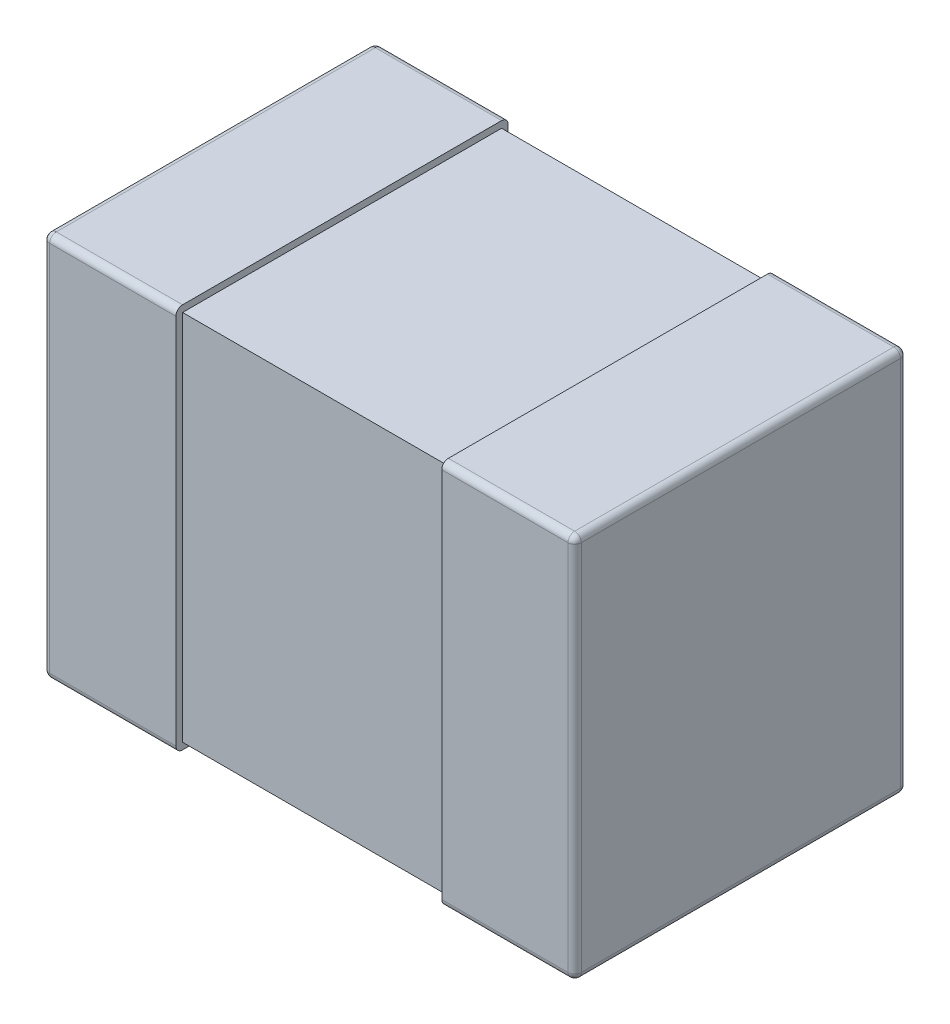
ISO-10303-21;
HEADER;
FILE_DESCRIPTION(('STEP AP214'),'2;1');
FILE_NAME('part.step','',(''),(''),'','','');
FILE_SCHEMA(('AUTOMOTIVE_DESIGN { 1 0 10303 214 1 1 1 1 }'));
ENDSEC;
DATA;
#1=APPLICATION_CONTEXT('core data for automotive mechanical design processes');
#2=APPLICATION_PROTOCOL_DEFINITION('international standard','automotive_design',2000,#1);
#3=PRODUCT_CONTEXT('',#1,'mechanical');
#4=PRODUCT('Part','Part','',(#3));
#5=PRODUCT_RELATED_PRODUCT_CATEGORY('part','',(#4));
#6=PRODUCT_DEFINITION_FORMATION('','',#4);
#7=PRODUCT_DEFINITION_CONTEXT('part definition',#1,'design');
#8=PRODUCT_DEFINITION('design','',#6,#7);
#9=PRODUCT_DEFINITION_SHAPE('','',#8);
#10=(LENGTH_UNIT() NAMED_UNIT(*) SI_UNIT(.MILLI.,.METRE.));
#11=(NAMED_UNIT(*) PLANE_ANGLE_UNIT() SI_UNIT($,.RADIAN.));
#12=(NAMED_UNIT(*) SI_UNIT($,.STERADIAN.) SOLID_ANGLE_UNIT());
#13=UNCERTAINTY_MEASURE_WITH_UNIT(LENGTH_MEASURE(1.E-05),#10,'distance_accuracy_value','');
#14=(GEOMETRIC_REPRESENTATION_CONTEXT(3) GLOBAL_UNCERTAINTY_ASSIGNED_CONTEXT((#13)) GLOBAL_UNIT_ASSIGNED_CONTEXT((#10,
#11,#12)) REPRESENTATION_CONTEXT('',''));
#15=CARTESIAN_POINT('',(0.,0.,0.));
#16=DIRECTION('',(0.,0.,1.));
#17=DIRECTION('',(1.,0.,0.));
#18=AXIS2_PLACEMENT_3D('',#15,#16,#17);
#19=CARTESIAN_POINT('',(-0.975,1.45,-0.6));
#20=DIRECTION('',(0.,-1.,0.));
#21=DIRECTION('',(0.,0.,-1.));
#22=AXIS2_PLACEMENT_3D('',#19,#20,#21);
#23=CYLINDRICAL_SURFACE('',#22,0.025);
#24=CARTESIAN_POINT('',(-0.975,1.425,-0.6));
#25=DIRECTION('',(0.,-1.,0.));
#26=DIRECTION('',(0.,0.,1.));
#27=AXIS2_PLACEMENT_3D('',#24,#25,#26);
#28=CIRCLE('',#27,0.025);
#29=CARTESIAN_POINT('',(-1.,1.425,-0.6));
#30=VERTEX_POINT('',#29);
#31=CARTESIAN_POINT('',(-0.975,1.425,-0.625));
#32=VERTEX_POINT('',#31);
#33=EDGE_CURVE('P0_E26',#30,#32,#28,.T.);
#34=ORIENTED_EDGE('',*,*,#33,.T.);
#35=DIRECTION('',(0.,1.,0.));
#36=VECTOR('',#35,1.);
#37=CARTESIAN_POINT('',(-0.975,1.45,-0.625));
#38=LINE('',#37,#36);
#39=CARTESIAN_POINT('',(-0.975,0.025,-0.625));
#40=VERTEX_POINT('',#39);
#41=EDGE_CURVE('P0_E154',#40,#32,#38,.T.);
#42=ORIENTED_EDGE('',*,*,#41,.F.);
#43=CARTESIAN_POINT('',(-0.975,0.025,-0.6));
#44=DIRECTION('',(0.,1.,0.));
#45=DIRECTION('',(0.,0.,-1.));
#46=AXIS2_PLACEMENT_3D('',#43,#44,#45);
#47=CIRCLE('',#46,0.025);
#48=CARTESIAN_POINT('',(-1.,0.025,-0.6));
#49=VERTEX_POINT('',#48);
#50=EDGE_CURVE('P0_E10',#40,#49,#47,.T.);
#51=ORIENTED_EDGE('',*,*,#50,.T.);
#52=DIRECTION('',(0.,-1.,0.));
#53=VECTOR('',#52,1.);
#54=CARTESIAN_POINT('',(-1.,1.45,-0.6));
#55=LINE('',#54,#53);
#56=EDGE_CURVE('P0_E165',#30,#49,#55,.T.);
#57=ORIENTED_EDGE('',*,*,#56,.F.);
#58=EDGE_LOOP('',(#34,#42,#51,#57));
#59=FACE_BOUND('',#58,.T.);
#60=ADVANCED_FACE('P0_F15',(#59),#23,.T.);
#61=CARTESIAN_POINT('',(-0.975,0.025,-0.6));
#62=DIRECTION('',(0.,1.,0.));
#63=DIRECTION('',(1.,0.,0.));
#64=AXIS2_PLACEMENT_3D('',#61,#62,#63);
#65=SPHERICAL_SURFACE('',#64,0.025);
#66=CARTESIAN_POINT('',(-0.975,0.025,-0.6));
#67=DIRECTION('',(-1.,0.,0.));
#68=DIRECTION('',(0.,0.,1.));
#69=AXIS2_PLACEMENT_3D('',#66,#67,#68);
#70=CIRCLE('',#69,0.025);
#71=CARTESIAN_POINT('',(-0.975,0.,-0.6));
#72=VERTEX_POINT('',#71);
#73=EDGE_CURVE('P0_E41',#40,#72,#70,.T.);
#74=ORIENTED_EDGE('',*,*,#73,.T.);
#75=CARTESIAN_POINT('',(-0.975,0.025,-0.6));
#76=DIRECTION('',(0.,0.,-1.));
#77=DIRECTION('',(-1.,0.,0.));
#78=AXIS2_PLACEMENT_3D('',#75,#76,#77);
#79=CIRCLE('',#78,0.025);
#80=EDGE_CURVE('P0_E216',#72,#49,#79,.T.);
#81=ORIENTED_EDGE('',*,*,#80,.T.);
#82=ORIENTED_EDGE('',*,*,#50,.F.);
#83=EDGE_LOOP('',(#74,#81,#82));
#84=FACE_BOUND('',#83,.T.);
#85=ADVANCED_FACE('P0_F467',(#84),#65,.T.);
#86=CARTESIAN_POINT('',(-0.975,1.425,-0.6));
#87=DIRECTION('',(0.,1.,0.));
#88=DIRECTION('',(1.,0.,0.));
#89=AXIS2_PLACEMENT_3D('',#86,#87,#88);
#90=SPHERICAL_SURFACE('',#89,0.025);
#91=CARTESIAN_POINT('',(-0.975,1.425,-0.6));
#92=DIRECTION('',(0.,0.,-1.));
#93=DIRECTION('',(0.,1.,0.));
#94=AXIS2_PLACEMENT_3D('',#91,#92,#93);
#95=CIRCLE('',#94,0.025);
#96=CARTESIAN_POINT('',(-0.975,1.45,-0.6));
#97=VERTEX_POINT('',#96);
#98=EDGE_CURVE('P0_E174',#30,#97,#95,.T.);
#99=ORIENTED_EDGE('',*,*,#98,.T.);
#100=CARTESIAN_POINT('',(-0.975,1.425,-0.6));
#101=DIRECTION('',(-1.,0.,0.));
#102=DIRECTION('',(0.,0.,1.));
#103=AXIS2_PLACEMENT_3D('',#100,#101,#102);
#104=CIRCLE('',#103,0.025);
#105=EDGE_CURVE('P0_E170',#97,#32,#104,.T.);
#106=ORIENTED_EDGE('',*,*,#105,.T.);
#107=ORIENTED_EDGE('',*,*,#33,.F.);
#108=EDGE_LOOP('',(#99,#106,#107));
#109=FACE_BOUND('',#108,.T.);
#110=ADVANCED_FACE('P0_F270',(#109),#90,.T.);
#111=CARTESIAN_POINT('',(-1.,0.025,-0.6));
#112=DIRECTION('',(1.,0.,0.));
#113=DIRECTION('',(0.,0.,-1.));
#114=AXIS2_PLACEMENT_3D('',#111,#112,#113);
#115=CYLINDRICAL_SURFACE('',#114,0.025);
#116=CARTESIAN_POINT('',(-0.5,0.025,-0.6));
#117=DIRECTION('',(1.,0.,0.));
#118=DIRECTION('',(0.,0.,1.));
#119=AXIS2_PLACEMENT_3D('',#116,#117,#118);
#120=CIRCLE('',#119,0.025);
#121=CARTESIAN_POINT('',(-0.5,0.,-0.6));
#122=VERTEX_POINT('',#121);
#123=CARTESIAN_POINT('',(-0.5,0.025,-0.625));
#124=VERTEX_POINT('',#123);
#125=EDGE_CURVE('P0_E196',#122,#124,#120,.T.);
#126=ORIENTED_EDGE('',*,*,#125,.F.);
#127=DIRECTION('',(1.,0.,0.));
#128=VECTOR('',#127,1.);
#129=CARTESIAN_POINT('',(-0.5,0.,-0.6));
#130=LINE('',#129,#128);
#131=EDGE_CURVE('P0_E205',#72,#122,#130,.T.);
#132=ORIENTED_EDGE('',*,*,#131,.F.);
#133=ORIENTED_EDGE('',*,*,#73,.F.);
#134=DIRECTION('',(-1.,0.,0.));
#135=VECTOR('',#134,1.);
#136=CARTESIAN_POINT('',(-1.,0.025,-0.625));
#137=LINE('',#136,#135);
#138=EDGE_CURVE('P0_E127',#124,#40,#137,.T.);
#139=ORIENTED_EDGE('',*,*,#138,.F.);
#140=EDGE_LOOP('',(#126,#132,#133,#139));
#141=FACE_BOUND('',#140,.T.);
#142=ADVANCED_FACE('P0_F434',(#141),#115,.T.);
#143=CARTESIAN_POINT('',(-0.975,0.025,0.625));
#144=DIRECTION('',(0.,0.,-1.));
#145=DIRECTION('',(-1.,0.,0.));
#146=AXIS2_PLACEMENT_3D('',#143,#144,#145);
#147=CYLINDRICAL_SURFACE('',#146,0.025);
#148=CARTESIAN_POINT('',(-0.975,0.025,0.6));
#149=DIRECTION('',(0.,0.,-1.));
#150=DIRECTION('',(1.,0.,0.));
#151=AXIS2_PLACEMENT_3D('',#148,#149,#150);
#152=CIRCLE('',#151,0.025);
#153=CARTESIAN_POINT('',(-0.975,0.,0.6));
#154=VERTEX_POINT('',#153);
#155=CARTESIAN_POINT('',(-1.,0.025,0.6));
#156=VERTEX_POINT('',#155);
#157=EDGE_CURVE('P0_E175',#154,#156,#152,.T.);
#158=ORIENTED_EDGE('',*,*,#157,.T.);
#159=DIRECTION('',(0.,0.,1.));
#160=VECTOR('',#159,1.);
#161=CARTESIAN_POINT('',(-1.,0.025,0.625));
#162=LINE('',#161,#160);
#163=EDGE_CURVE('P0_E176',#49,#156,#162,.T.);
#164=ORIENTED_EDGE('',*,*,#163,.F.);
#165=ORIENTED_EDGE('',*,*,#80,.F.);
#166=DIRECTION('',(0.,0.,-1.));
#167=VECTOR('',#166,1.);
#168=CARTESIAN_POINT('',(-0.975,0.,-0.625));
#169=LINE('',#168,#167);
#170=EDGE_CURVE('P0_E200',#154,#72,#169,.T.);
#171=ORIENTED_EDGE('',*,*,#170,.F.);
#172=EDGE_LOOP('',(#158,#164,#165,#171));
#173=FACE_BOUND('',#172,.T.);
#174=ADVANCED_FACE('P0_F439',(#173),#147,.T.);
#175=CARTESIAN_POINT('',(-0.975,1.425,0.));
#176=DIRECTION('',(0.,0.,1.));
#177=DIRECTION('',(1.,0.,0.));
#178=AXIS2_PLACEMENT_3D('',#175,#176,#177);
#179=CYLINDRICAL_SURFACE('',#178,0.025);
#180=CARTESIAN_POINT('',(-0.975,1.425,0.6));
#181=DIRECTION('',(0.,0.,-1.));
#182=DIRECTION('',(1.,0.,0.));
#183=AXIS2_PLACEMENT_3D('',#180,#181,#182);
#184=CIRCLE('',#183,0.025);
#185=CARTESIAN_POINT('',(-1.,1.425,0.6));
#186=VERTEX_POINT('',#185);
#187=CARTESIAN_POINT('',(-0.975,1.45,0.6));
#188=VERTEX_POINT('',#187);
#189=EDGE_CURVE('P0_E169',#186,#188,#184,.T.);
#190=ORIENTED_EDGE('',*,*,#189,.T.);
#191=DIRECTION('',(0.,0.,1.));
#192=VECTOR('',#191,1.);
#193=CARTESIAN_POINT('',(-0.975,1.45,0.));
#194=LINE('',#193,#192);
#195=EDGE_CURVE('P0_E201',#97,#188,#194,.T.);
#196=ORIENTED_EDGE('',*,*,#195,.F.);
#197=ORIENTED_EDGE('',*,*,#98,.F.);
#198=DIRECTION('',(0.,0.,-1.));
#199=VECTOR('',#198,1.);
#200=CARTESIAN_POINT('',(-1.,1.425,0.625));
#201=LINE('',#200,#199);
#202=EDGE_CURVE('P0_E162',#186,#30,#201,.T.);
#203=ORIENTED_EDGE('',*,*,#202,.F.);
#204=EDGE_LOOP('',(#190,#196,#197,#203));
#205=FACE_BOUND('',#204,.T.);
#206=ADVANCED_FACE('P0_F273',(#205),#179,.T.);
#207=CARTESIAN_POINT('',(0.,1.425,-0.6));
#208=DIRECTION('',(-1.,0.,0.));
#209=DIRECTION('',(0.,0.,1.));
#210=AXIS2_PLACEMENT_3D('',#207,#208,#209);
#211=CYLINDRICAL_SURFACE('',#210,0.025);
#212=CARTESIAN_POINT('',(-0.5,1.425,-0.6));
#213=DIRECTION('',(1.,0.,0.));
#214=DIRECTION('',(0.,0.,1.));
#215=AXIS2_PLACEMENT_3D('',#212,#213,#214);
#216=CIRCLE('',#215,0.025);
#217=CARTESIAN_POINT('',(-0.5,1.425,-0.625));
#218=VERTEX_POINT('',#217);
#219=CARTESIAN_POINT('',(-0.5,1.45,-0.6));
#220=VERTEX_POINT('',#219);
#221=EDGE_CURVE('P0_E184',#218,#220,#216,.T.);
#222=ORIENTED_EDGE('',*,*,#221,.F.);
#223=DIRECTION('',(1.,0.,0.));
#224=VECTOR('',#223,1.);
#225=CARTESIAN_POINT('',(-1.,1.425,-0.625));
#226=LINE('',#225,#224);
#227=EDGE_CURVE('P0_E226',#32,#218,#226,.T.);
#228=ORIENTED_EDGE('',*,*,#227,.F.);
#229=ORIENTED_EDGE('',*,*,#105,.F.);
#230=DIRECTION('',(-1.,0.,0.));
#231=VECTOR('',#230,1.);
#232=CARTESIAN_POINT('',(0.,1.45,-0.6));
#233=LINE('',#232,#231);
#234=EDGE_CURVE('P0_E19',#220,#97,#233,.T.);
#235=ORIENTED_EDGE('',*,*,#234,.F.);
#236=EDGE_LOOP('',(#222,#228,#229,#235));
#237=FACE_BOUND('',#236,.T.);
#238=ADVANCED_FACE('P0_F518',(#237),#211,.T.);
#239=CARTESIAN_POINT('',(-0.975,0.025,0.6));
#240=DIRECTION('',(0.,1.,0.));
#241=DIRECTION('',(1.,0.,0.));
#242=AXIS2_PLACEMENT_3D('',#239,#240,#241);
#243=SPHERICAL_SURFACE('',#242,0.025);
#244=CARTESIAN_POINT('',(-0.975,0.025,0.6));
#245=DIRECTION('',(-1.,0.,0.));
#246=DIRECTION('',(0.,0.,1.));
#247=AXIS2_PLACEMENT_3D('',#244,#245,#246);
#248=CIRCLE('',#247,0.025);
#249=CARTESIAN_POINT('',(-0.975,0.025,0.625));
#250=VERTEX_POINT('',#249);
#251=EDGE_CURVE('P0_E159',#154,#250,#248,.T.);
#252=ORIENTED_EDGE('',*,*,#251,.T.);
#253=CARTESIAN_POINT('',(-0.975,0.025,0.6));
#254=DIRECTION('',(0.,-1.,0.));
#255=DIRECTION('',(0.,0.,-1.));
#256=AXIS2_PLACEMENT_3D('',#253,#254,#255);
#257=CIRCLE('',#256,0.025);
#258=EDGE_CURVE('P0_E160',#250,#156,#257,.T.);
#259=ORIENTED_EDGE('',*,*,#258,.T.);
#260=ORIENTED_EDGE('',*,*,#157,.F.);
#261=EDGE_LOOP('',(#252,#259,#260));
#262=FACE_BOUND('',#261,.T.);
#263=ADVANCED_FACE('P0_F523',(#262),#243,.T.);
#264=CARTESIAN_POINT('',(-0.975,1.425,0.6));
#265=DIRECTION('',(0.,1.,0.));
#266=DIRECTION('',(1.,0.,0.));
#267=AXIS2_PLACEMENT_3D('',#264,#265,#266);
#268=SPHERICAL_SURFACE('',#267,0.025);
#269=CARTESIAN_POINT('',(-0.975,1.425,0.6));
#270=DIRECTION('',(0.,1.,0.));
#271=DIRECTION('',(0.,0.,1.));
#272=AXIS2_PLACEMENT_3D('',#269,#270,#271);
#273=CIRCLE('',#272,0.025);
#274=CARTESIAN_POINT('',(-0.975,1.425,0.625));
#275=VERTEX_POINT('',#274);
#276=EDGE_CURVE('P0_E156',#186,#275,#273,.T.);
#277=ORIENTED_EDGE('',*,*,#276,.T.);
#278=CARTESIAN_POINT('',(-0.975,1.425,0.6));
#279=DIRECTION('',(-1.,0.,0.));
#280=DIRECTION('',(0.,0.,1.));
#281=AXIS2_PLACEMENT_3D('',#278,#279,#280);
#282=CIRCLE('',#281,0.025);
#283=EDGE_CURVE('P0_E188',#275,#188,#282,.T.);
#284=ORIENTED_EDGE('',*,*,#283,.T.);
#285=ORIENTED_EDGE('',*,*,#189,.F.);
#286=EDGE_LOOP('',(#277,#284,#285));
#287=FACE_BOUND('',#286,.T.);
#288=ADVANCED_FACE('P0_F278',(#287),#268,.T.);
#289=CARTESIAN_POINT('',(-1.,0.025,0.6));
#290=DIRECTION('',(-1.,0.,0.));
#291=DIRECTION('',(0.,0.,1.));
#292=AXIS2_PLACEMENT_3D('',#289,#290,#291);
#293=CYLINDRICAL_SURFACE('',#292,0.025);
#294=CARTESIAN_POINT('',(-0.5,0.025,0.6));
#295=DIRECTION('',(1.,0.,0.));
#296=DIRECTION('',(0.,0.,1.));
#297=AXIS2_PLACEMENT_3D('',#294,#295,#296);
#298=CIRCLE('',#297,0.025);
#299=CARTESIAN_POINT('',(-0.5,0.025,0.625));
#300=VERTEX_POINT('',#299);
#301=CARTESIAN_POINT('',(-0.5,0.,0.6));
#302=VERTEX_POINT('',#301);
#303=EDGE_CURVE('P0_E114',#300,#302,#298,.T.);
#304=ORIENTED_EDGE('',*,*,#303,.F.);
#305=DIRECTION('',(1.,0.,0.));
#306=VECTOR('',#305,1.);
#307=CARTESIAN_POINT('',(-0.5,0.025,0.625));
#308=LINE('',#307,#306);
#309=EDGE_CURVE('P0_E119',#250,#300,#308,.T.);
#310=ORIENTED_EDGE('',*,*,#309,.F.);
#311=ORIENTED_EDGE('',*,*,#251,.F.);
#312=DIRECTION('',(-1.,0.,0.));
#313=VECTOR('',#312,1.);
#314=CARTESIAN_POINT('',(-1.,0.,0.6));
#315=LINE('',#314,#313);
#316=EDGE_CURVE('P0_E122',#302,#154,#315,.T.);
#317=ORIENTED_EDGE('',*,*,#316,.F.);
#318=EDGE_LOOP('',(#304,#310,#311,#317));
#319=FACE_BOUND('',#318,.T.);
#320=ADVANCED_FACE('P0_F116',(#319),#293,.T.);
#321=CARTESIAN_POINT('',(-0.975,1.45,0.6));
#322=DIRECTION('',(0.,-1.,0.));
#323=DIRECTION('',(0.,0.,-1.));
#324=AXIS2_PLACEMENT_3D('',#321,#322,#323);
#325=CYLINDRICAL_SURFACE('',#324,0.025);
#326=ORIENTED_EDGE('',*,*,#258,.F.);
#327=DIRECTION('',(0.,-1.,0.));
#328=VECTOR('',#327,1.);
#329=CARTESIAN_POINT('',(-0.975,1.45,0.625));
#330=LINE('',#329,#328);
#331=EDGE_CURVE('P0_E143',#275,#250,#330,.T.);
#332=ORIENTED_EDGE('',*,*,#331,.F.);
#333=ORIENTED_EDGE('',*,*,#276,.F.);
#334=DIRECTION('',(0.,1.,0.));
#335=VECTOR('',#334,1.);
#336=CARTESIAN_POINT('',(-1.,1.45,0.6));
#337=LINE('',#336,#335);
#338=EDGE_CURVE('P0_E150',#156,#186,#337,.T.);
#339=ORIENTED_EDGE('',*,*,#338,.F.);
#340=EDGE_LOOP('',(#326,#332,#333,#339));
#341=FACE_BOUND('',#340,.T.);
#342=ADVANCED_FACE('P0_F454',(#341),#325,.T.);
#343=CARTESIAN_POINT('',(0.,1.425,0.6));
#344=DIRECTION('',(1.,0.,0.));
#345=DIRECTION('',(0.,0.,-1.));
#346=AXIS2_PLACEMENT_3D('',#343,#344,#345);
#347=CYLINDRICAL_SURFACE('',#346,0.025);
#348=CARTESIAN_POINT('',(-0.5,1.425,0.6));
#349=DIRECTION('',(1.,0.,0.));
#350=DIRECTION('',(0.,0.,1.));
#351=AXIS2_PLACEMENT_3D('',#348,#349,#350);
#352=CIRCLE('',#351,0.025);
#353=CARTESIAN_POINT('',(-0.5,1.45,0.6));
#354=VERTEX_POINT('',#353);
#355=CARTESIAN_POINT('',(-0.5,1.425,0.625));
#356=VERTEX_POINT('',#355);
#357=EDGE_CURVE('P0_E128',#354,#356,#352,.T.);
#358=ORIENTED_EDGE('',*,*,#357,.F.);
#359=DIRECTION('',(1.,0.,0.));
#360=VECTOR('',#359,1.);
#361=CARTESIAN_POINT('',(0.,1.45,0.6));
#362=LINE('',#361,#360);
#363=EDGE_CURVE('P0_E197',#188,#354,#362,.T.);
#364=ORIENTED_EDGE('',*,*,#363,.F.);
#365=ORIENTED_EDGE('',*,*,#283,.F.);
#366=DIRECTION('',(-1.,0.,0.));
#367=VECTOR('',#366,1.);
#368=CARTESIAN_POINT('',(-1.,1.425,0.625));
#369=LINE('',#368,#367);
#370=EDGE_CURVE('P0_E139',#356,#275,#369,.T.);
#371=ORIENTED_EDGE('',*,*,#370,.F.);
#372=EDGE_LOOP('',(#358,#364,#365,#371));
#373=FACE_BOUND('',#372,.T.);
#374=ADVANCED_FACE('P0_F280',(#373),#347,.T.);
#375=CARTESIAN_POINT('',(0.,0.,0.));
#376=DIRECTION('',(0.,-1.,0.));
#377=DIRECTION('',(0.,0.,-1.));
#378=AXIS2_PLACEMENT_3D('',#375,#376,#377);
#379=PLANE('',#378);
#380=ORIENTED_EDGE('',*,*,#170,.T.);
#381=ORIENTED_EDGE('',*,*,#131,.T.);
#382=DIRECTION('',(0.,0.,-1.));
#383=VECTOR('',#382,1.);
#384=CARTESIAN_POINT('',(-0.5,0.,0.625));
#385=LINE('',#384,#383);
#386=EDGE_CURVE('P0_E208',#302,#122,#385,.T.);
#387=ORIENTED_EDGE('',*,*,#386,.F.);
#388=ORIENTED_EDGE('',*,*,#316,.T.);
#389=EDGE_LOOP('',(#380,#381,#387,#388));
#390=FACE_BOUND('',#389,.T.);
#391=ADVANCED_FACE('P0_F589',(#390),#379,.T.);
#392=CARTESIAN_POINT('',(0.,1.45,0.));
#393=DIRECTION('',(0.,-1.,0.));
#394=DIRECTION('',(0.,0.,-1.));
#395=AXIS2_PLACEMENT_3D('',#392,#393,#394);
#396=PLANE('',#395);
#397=DIRECTION('',(0.,0.,-1.));
#398=VECTOR('',#397,1.);
#399=CARTESIAN_POINT('',(-0.5,1.45,0.625));
#400=LINE('',#399,#398);
#401=EDGE_CURVE('P0_E180',#354,#220,#400,.T.);
#402=ORIENTED_EDGE('',*,*,#401,.T.);
#403=ORIENTED_EDGE('',*,*,#234,.T.);
#404=ORIENTED_EDGE('',*,*,#195,.T.);
#405=ORIENTED_EDGE('',*,*,#363,.T.);
#406=EDGE_LOOP('',(#402,#403,#404,#405));
#407=FACE_BOUND('',#406,.T.);
#408=ADVANCED_FACE('P0_F17',(#407),#396,.F.);
#409=CARTESIAN_POINT('',(-1.,1.45,-0.625));
#410=DIRECTION('',(0.,0.,1.));
#411=DIRECTION('',(1.,0.,0.));
#412=AXIS2_PLACEMENT_3D('',#409,#410,#411);
#413=PLANE('',#412);
#414=DIRECTION('',(0.,-1.,0.));
#415=VECTOR('',#414,1.);
#416=CARTESIAN_POINT('',(-0.5,1.45,-0.625));
#417=LINE('',#416,#415);
#418=EDGE_CURVE('P0_E192',#218,#124,#417,.T.);
#419=ORIENTED_EDGE('',*,*,#418,.T.);
#420=ORIENTED_EDGE('',*,*,#138,.T.);
#421=ORIENTED_EDGE('',*,*,#41,.T.);
#422=ORIENTED_EDGE('',*,*,#227,.T.);
#423=EDGE_LOOP('',(#419,#420,#421,#422));
#424=FACE_BOUND('',#423,.T.);
#425=ADVANCED_FACE('P0_F490',(#424),#413,.F.);
#426=CARTESIAN_POINT('',(-0.5,1.45,0.625));
#427=DIRECTION('',(-1.,0.,0.));
#428=DIRECTION('',(0.,0.,1.));
#429=AXIS2_PLACEMENT_3D('',#426,#427,#428);
#430=PLANE('',#429);
#431=ORIENTED_EDGE('',*,*,#386,.T.);
#432=ORIENTED_EDGE('',*,*,#125,.T.);
#433=ORIENTED_EDGE('',*,*,#418,.F.);
#434=ORIENTED_EDGE('',*,*,#221,.T.);
#435=ORIENTED_EDGE('',*,*,#401,.F.);
#436=ORIENTED_EDGE('',*,*,#357,.T.);
#437=DIRECTION('',(0.,-1.,0.));
#438=VECTOR('',#437,1.);
#439=CARTESIAN_POINT('',(-0.5,1.45,0.625));
#440=LINE('',#439,#438);
#441=EDGE_CURVE('P0_E131',#356,#300,#440,.T.);
#442=ORIENTED_EDGE('',*,*,#441,.T.);
#443=ORIENTED_EDGE('',*,*,#303,.T.);
#444=EDGE_LOOP('',(#431,#432,#433,#434,#435,#436,#442,#443));
#445=FACE_BOUND('',#444,.T.);
#446=ADVANCED_FACE('P0_F132',(#445),#430,.F.);
#447=CARTESIAN_POINT('',(-1.,1.45,0.625));
#448=DIRECTION('',(0.,0.,-1.));
#449=DIRECTION('',(0.,-1.,0.));
#450=AXIS2_PLACEMENT_3D('',#447,#448,#449);
#451=PLANE('',#450);
#452=ORIENTED_EDGE('',*,*,#331,.T.);
#453=ORIENTED_EDGE('',*,*,#309,.T.);
#454=ORIENTED_EDGE('',*,*,#441,.F.);
#455=ORIENTED_EDGE('',*,*,#370,.T.);
#456=EDGE_LOOP('',(#452,#453,#454,#455));
#457=FACE_BOUND('',#456,.T.);
#458=ADVANCED_FACE('P0_F141',(#457),#451,.F.);
#459=CARTESIAN_POINT('',(-1.,1.45,0.625));
#460=DIRECTION('',(1.,0.,0.));
#461=DIRECTION('',(0.,1.,0.));
#462=AXIS2_PLACEMENT_3D('',#459,#460,#461);
#463=PLANE('',#462);
#464=ORIENTED_EDGE('',*,*,#202,.T.);
#465=ORIENTED_EDGE('',*,*,#56,.T.);
#466=ORIENTED_EDGE('',*,*,#163,.T.);
#467=ORIENTED_EDGE('',*,*,#338,.T.);
#468=EDGE_LOOP('',(#464,#465,#466,#467));
#469=FACE_BOUND('',#468,.T.);
#470=ADVANCED_FACE('P0_F259',(#469),#463,.F.);
#471=CLOSED_SHELL('',(#60,#85,#110,#142,#174,#206,#238,#263,#288,#320,#342,#374,#391,#408,#425,
#446,#458,#470));
#472=MANIFOLD_SOLID_BREP('P0_B1',#471);
#473=CARTESIAN_POINT('',(0.5,1.45,0.625));
#474=DIRECTION('',(1.,0.,0.));
#475=DIRECTION('',(0.,1.,0.));
#476=AXIS2_PLACEMENT_3D('',#473,#474,#475);
#477=PLANE('',#476);
#478=DIRECTION('',(0.,0.,1.));
#479=VECTOR('',#478,1.);
#480=CARTESIAN_POINT('',(0.5,1.425,-0.6));
#481=LINE('',#480,#479);
#482=CARTESIAN_POINT('',(0.5,1.425,-0.6));
#483=VERTEX_POINT('',#482);
#484=CARTESIAN_POINT('',(0.5,1.425,0.6));
#485=VERTEX_POINT('',#484);
#486=EDGE_CURVE('P1_E27',#483,#485,#481,.T.);
#487=ORIENTED_EDGE('',*,*,#486,.T.);
#488=DIRECTION('',(0.,-1.,0.));
#489=VECTOR('',#488,1.);
#490=CARTESIAN_POINT('',(0.5,1.425,0.6));
#491=LINE('',#490,#489);
#492=CARTESIAN_POINT('',(0.5,0.025,0.6));
#493=VERTEX_POINT('',#492);
#494=EDGE_CURVE('P1_E71',#485,#493,#491,.T.);
#495=ORIENTED_EDGE('',*,*,#494,.T.);
#496=DIRECTION('',(0.,0.,-1.));
#497=VECTOR('',#496,1.);
#498=CARTESIAN_POINT('',(0.5,0.025,0.6));
#499=LINE('',#498,#497);
#500=CARTESIAN_POINT('',(0.5,0.025,-0.6));
#501=VERTEX_POINT('',#500);
#502=EDGE_CURVE('P1_E96',#493,#501,#499,.T.);
#503=ORIENTED_EDGE('',*,*,#502,.T.);
#504=DIRECTION('',(0.,1.,0.));
#505=VECTOR('',#504,1.);
#506=CARTESIAN_POINT('',(0.5,0.025,-0.6));
#507=LINE('',#506,#505);
#508=EDGE_CURVE('P1_E20',#501,#483,#507,.T.);
#509=ORIENTED_EDGE('',*,*,#508,.T.);
#510=EDGE_LOOP('',(#487,#495,#503,#509));
#511=FACE_BOUND('',#510,.T.);
#512=ADVANCED_FACE('P1_F17',(#511),#477,.T.);
#513=CARTESIAN_POINT('',(-0.5,0.,0.));
#514=DIRECTION('',(1.,0.,0.));
#515=DIRECTION('',(0.,1.,0.));
#516=AXIS2_PLACEMENT_3D('',#513,#514,#515);
#517=PLANE('',#516);
#518=DIRECTION('',(0.,-1.,0.));
#519=VECTOR('',#518,1.);
#520=CARTESIAN_POINT('',(-0.5,1.425,0.6));
#521=LINE('',#520,#519);
#522=CARTESIAN_POINT('',(-0.5,1.425,0.6));
#523=VERTEX_POINT('',#522);
#524=CARTESIAN_POINT('',(-0.5,0.025,0.6));
#525=VERTEX_POINT('',#524);
#526=EDGE_CURVE('P1_E83',#523,#525,#521,.T.);
#527=ORIENTED_EDGE('',*,*,#526,.F.);
#528=DIRECTION('',(0.,0.,1.));
#529=VECTOR('',#528,1.);
#530=CARTESIAN_POINT('',(-0.5,1.425,-0.6));
#531=LINE('',#530,#529);
#532=CARTESIAN_POINT('',(-0.5,1.425,-0.6));
#533=VERTEX_POINT('',#532);
#534=EDGE_CURVE('P1_E11',#533,#523,#531,.T.);
#535=ORIENTED_EDGE('',*,*,#534,.F.);
#536=DIRECTION('',(0.,1.,0.));
#537=VECTOR('',#536,1.);
#538=CARTESIAN_POINT('',(-0.5,0.025,-0.6));
#539=LINE('',#538,#537);
#540=CARTESIAN_POINT('',(-0.5,0.025,-0.6));
#541=VERTEX_POINT('',#540);
#542=EDGE_CURVE('P1_E99',#541,#533,#539,.T.);
#543=ORIENTED_EDGE('',*,*,#542,.F.);
#544=DIRECTION('',(0.,0.,-1.));
#545=VECTOR('',#544,1.);
#546=CARTESIAN_POINT('',(-0.5,0.025,0.6));
#547=LINE('',#546,#545);
#548=EDGE_CURVE('P1_E95',#525,#541,#547,.T.);
#549=ORIENTED_EDGE('',*,*,#548,.F.);
#550=EDGE_LOOP('',(#527,#535,#543,#549));
#551=FACE_BOUND('',#550,.T.);
#552=ADVANCED_FACE('P1_F118',(#551),#517,.F.);
#553=CARTESIAN_POINT('',(2.34390889145857,1.425,-0.6));
#554=DIRECTION('',(0.,-1.,0.));
#555=DIRECTION('',(0.,0.,-1.));
#556=AXIS2_PLACEMENT_3D('',#553,#554,#555);
#557=PLANE('',#556);
#558=ORIENTED_EDGE('',*,*,#486,.F.);
#559=DIRECTION('',(-1.,0.,0.));
#560=VECTOR('',#559,1.);
#561=CARTESIAN_POINT('',(2.34390889145857,1.425,-0.6));
#562=LINE('',#561,#560);
#563=EDGE_CURVE('P1_E75',#483,#533,#562,.T.);
#564=ORIENTED_EDGE('',*,*,#563,.T.);
#565=ORIENTED_EDGE('',*,*,#534,.T.);
#566=DIRECTION('',(-1.,0.,0.));
#567=VECTOR('',#566,1.);
#568=CARTESIAN_POINT('',(2.34390889145857,1.425,0.6));
#569=LINE('',#568,#567);
#570=EDGE_CURVE('P1_E78',#485,#523,#569,.T.);
#571=ORIENTED_EDGE('',*,*,#570,.F.);
#572=EDGE_LOOP('',(#558,#564,#565,#571));
#573=FACE_BOUND('',#572,.T.);
#574=ADVANCED_FACE('P1_F79',(#573),#557,.F.);
#575=CARTESIAN_POINT('',(2.34390889145857,0.025,-0.6));
#576=DIRECTION('',(0.,0.,1.));
#577=DIRECTION('',(0.,-1.,0.));
#578=AXIS2_PLACEMENT_3D('',#575,#576,#577);
#579=PLANE('',#578);
#580=ORIENTED_EDGE('',*,*,#508,.F.);
#581=DIRECTION('',(-1.,0.,0.));
#582=VECTOR('',#581,1.);
#583=CARTESIAN_POINT('',(2.34390889145857,0.025,-0.6));
#584=LINE('',#583,#582);
#585=EDGE_CURVE('P1_E105',#501,#541,#584,.T.);
#586=ORIENTED_EDGE('',*,*,#585,.T.);
#587=ORIENTED_EDGE('',*,*,#542,.T.);
#588=ORIENTED_EDGE('',*,*,#563,.F.);
#589=EDGE_LOOP('',(#580,#586,#587,#588));
#590=FACE_BOUND('',#589,.T.);
#591=ADVANCED_FACE('P1_F203',(#590),#579,.F.);
#592=CARTESIAN_POINT('',(2.34390889145857,0.025,0.6));
#593=DIRECTION('',(0.,1.,0.));
#594=DIRECTION('',(0.,0.,-1.));
#595=AXIS2_PLACEMENT_3D('',#592,#593,#594);
#596=PLANE('',#595);
#597=ORIENTED_EDGE('',*,*,#502,.F.);
#598=DIRECTION('',(-1.,0.,0.));
#599=VECTOR('',#598,1.);
#600=CARTESIAN_POINT('',(2.34390889145857,0.025,0.6));
#601=LINE('',#600,#599);
#602=EDGE_CURVE('P1_E87',#493,#525,#601,.T.);
#603=ORIENTED_EDGE('',*,*,#602,.T.);
#604=ORIENTED_EDGE('',*,*,#548,.T.);
#605=ORIENTED_EDGE('',*,*,#585,.F.);
#606=EDGE_LOOP('',(#597,#603,#604,#605));
#607=FACE_BOUND('',#606,.T.);
#608=ADVANCED_FACE('P1_F116',(#607),#596,.F.);
#609=CARTESIAN_POINT('',(2.34390889145857,1.425,0.6));
#610=DIRECTION('',(0.,0.,-1.));
#611=DIRECTION('',(-1.,0.,0.));
#612=AXIS2_PLACEMENT_3D('',#609,#610,#611);
#613=PLANE('',#612);
#614=ORIENTED_EDGE('',*,*,#494,.F.);
#615=ORIENTED_EDGE('',*,*,#570,.T.);
#616=ORIENTED_EDGE('',*,*,#526,.T.);
#617=ORIENTED_EDGE('',*,*,#602,.F.);
#618=EDGE_LOOP('',(#614,#615,#616,#617));
#619=FACE_BOUND('',#618,.T.);
#620=ADVANCED_FACE('P1_F85',(#619),#613,.F.);
#621=CLOSED_SHELL('',(#512,#552,#574,#591,#608,#620));
#622=MANIFOLD_SOLID_BREP('P1_B1',#621);
#623=CARTESIAN_POINT('',(0.975,1.45,-0.6));
#624=DIRECTION('',(0.,-1.,0.));
#625=DIRECTION('',(0.,0.,-1.));
#626=AXIS2_PLACEMENT_3D('',#623,#624,#625);
#627=CYLINDRICAL_SURFACE('',#626,0.025);
#628=CARTESIAN_POINT('',(0.975,1.425,-0.6));
#629=DIRECTION('',(0.,1.,0.));
#630=DIRECTION('',(0.,0.,1.));
#631=AXIS2_PLACEMENT_3D('',#628,#629,#630);
#632=CIRCLE('',#631,0.025);
#633=CARTESIAN_POINT('',(1.,1.425,-0.6));
#634=VERTEX_POINT('',#633);
#635=CARTESIAN_POINT('',(0.975,1.425,-0.625));
#636=VERTEX_POINT('',#635);
#637=EDGE_CURVE('P2_E26',#634,#636,#632,.T.);
#638=ORIENTED_EDGE('',*,*,#637,.F.);
#639=DIRECTION('',(0.,-1.,0.));
#640=VECTOR('',#639,1.);
#641=CARTESIAN_POINT('',(1.,1.45,-0.6));
#642=LINE('',#641,#640);
#643=CARTESIAN_POINT('',(1.,0.025,-0.6));
#644=VERTEX_POINT('',#643);
#645=EDGE_CURVE('P2_E135',#634,#644,#642,.T.);
#646=ORIENTED_EDGE('',*,*,#645,.T.);
#647=CARTESIAN_POINT('',(0.975,0.025,-0.6));
#648=DIRECTION('',(0.,-1.,0.));
#649=DIRECTION('',(0.,0.,-1.));
#650=AXIS2_PLACEMENT_3D('',#647,#648,#649);
#651=CIRCLE('',#650,0.025);
#652=CARTESIAN_POINT('',(0.975,0.025,-0.625));
#653=VERTEX_POINT('',#652);
#654=EDGE_CURVE('P2_E10',#653,#644,#651,.T.);
#655=ORIENTED_EDGE('',*,*,#654,.F.);
#656=DIRECTION('',(0.,1.,0.));
#657=VECTOR('',#656,1.);
#658=CARTESIAN_POINT('',(0.975,1.45,-0.625));
#659=LINE('',#658,#657);
#660=EDGE_CURVE('P2_E132',#653,#636,#659,.T.);
#661=ORIENTED_EDGE('',*,*,#660,.T.);
#662=EDGE_LOOP('',(#638,#646,#655,#661));
#663=FACE_BOUND('',#662,.T.);
#664=ADVANCED_FACE('P2_F15',(#663),#627,.T.);
#665=CARTESIAN_POINT('',(0.975,0.025,-0.6));
#666=DIRECTION('',(0.,-1.,0.));
#667=DIRECTION('',(-1.,0.,0.));
#668=AXIS2_PLACEMENT_3D('',#665,#666,#667);
#669=SPHERICAL_SURFACE('',#668,0.025);
#670=CARTESIAN_POINT('',(0.975,0.025,-0.6));
#671=DIRECTION('',(-1.,0.,0.));
#672=DIRECTION('',(0.,0.,1.));
#673=AXIS2_PLACEMENT_3D('',#670,#671,#672);
#674=CIRCLE('',#673,0.025);
#675=CARTESIAN_POINT('',(0.975,0.,-0.6));
#676=VERTEX_POINT('',#675);
#677=EDGE_CURVE('P2_E41',#653,#676,#674,.T.);
#678=ORIENTED_EDGE('',*,*,#677,.F.);
#679=ORIENTED_EDGE('',*,*,#654,.T.);
#680=CARTESIAN_POINT('',(0.975,0.025,-0.6));
#681=DIRECTION('',(0.,0.,1.));
#682=DIRECTION('',(1.,0.,0.));
#683=AXIS2_PLACEMENT_3D('',#680,#681,#682);
#684=CIRCLE('',#683,0.025);
#685=EDGE_CURVE('P2_E140',#676,#644,#684,.T.);
#686=ORIENTED_EDGE('',*,*,#685,.F.);
#687=EDGE_LOOP('',(#678,#679,#686));
#688=FACE_BOUND('',#687,.T.);
#689=ADVANCED_FACE('P2_F139',(#688),#669,.T.);
#690=CARTESIAN_POINT('',(0.975,1.425,-0.6));
#691=DIRECTION('',(0.,-1.,0.));
#692=DIRECTION('',(-1.,0.,0.));
#693=AXIS2_PLACEMENT_3D('',#690,#691,#692);
#694=SPHERICAL_SURFACE('',#693,0.025);
#695=CARTESIAN_POINT('',(0.975,1.425,-0.6));
#696=DIRECTION('',(0.,0.,1.));
#697=DIRECTION('',(0.,1.,0.));
#698=AXIS2_PLACEMENT_3D('',#695,#696,#697);
#699=CIRCLE('',#698,0.025);
#700=CARTESIAN_POINT('',(0.975,1.45,-0.6));
#701=VERTEX_POINT('',#700);
#702=EDGE_CURVE('P2_E223',#634,#701,#699,.T.);
#703=ORIENTED_EDGE('',*,*,#702,.F.);
#704=ORIENTED_EDGE('',*,*,#637,.T.);
#705=CARTESIAN_POINT('',(0.975,1.425,-0.6));
#706=DIRECTION('',(-1.,0.,0.));
#707=DIRECTION('',(0.,0.,1.));
#708=AXIS2_PLACEMENT_3D('',#705,#706,#707);
#709=CIRCLE('',#708,0.025);
#710=EDGE_CURVE('P2_E196',#701,#636,#709,.T.);
#711=ORIENTED_EDGE('',*,*,#710,.F.);
#712=EDGE_LOOP('',(#703,#704,#711));
#713=FACE_BOUND('',#712,.T.);
#714=ADVANCED_FACE('P2_F265',(#713),#694,.T.);
#715=CARTESIAN_POINT('',(1.,0.025,-0.6));
#716=DIRECTION('',(-1.,0.,0.));
#717=DIRECTION('',(0.,0.,-1.));
#718=AXIS2_PLACEMENT_3D('',#715,#716,#717);
#719=CYLINDRICAL_SURFACE('',#718,0.025);
#720=CARTESIAN_POINT('',(0.5,0.025,-0.6));
#721=DIRECTION('',(1.,0.,0.));
#722=DIRECTION('',(0.,0.,1.));
#723=AXIS2_PLACEMENT_3D('',#720,#721,#722);
#724=CIRCLE('',#723,0.025);
#725=CARTESIAN_POINT('',(0.5,0.,-0.6));
#726=VERTEX_POINT('',#725);
#727=CARTESIAN_POINT('',(0.5,0.025,-0.625));
#728=VERTEX_POINT('',#727);
#729=EDGE_CURVE('P2_E147',#726,#728,#724,.T.);
#730=ORIENTED_EDGE('',*,*,#729,.T.);
#731=DIRECTION('',(1.,0.,0.));
#732=VECTOR('',#731,1.);
#733=CARTESIAN_POINT('',(1.,0.025,-0.625));
#734=LINE('',#733,#732);
#735=EDGE_CURVE('P2_E145',#728,#653,#734,.T.);
#736=ORIENTED_EDGE('',*,*,#735,.T.);
#737=ORIENTED_EDGE('',*,*,#677,.T.);
#738=DIRECTION('',(-1.,0.,0.));
#739=VECTOR('',#738,1.);
#740=CARTESIAN_POINT('',(0.5,0.,-0.6));
#741=LINE('',#740,#739);
#742=EDGE_CURVE('P2_E237',#676,#726,#741,.T.);
#743=ORIENTED_EDGE('',*,*,#742,.T.);
#744=EDGE_LOOP('',(#730,#736,#737,#743));
#745=FACE_BOUND('',#744,.T.);
#746=ADVANCED_FACE('P2_F17',(#745),#719,.T.);
#747=CARTESIAN_POINT('',(0.975,0.025,0.625));
#748=DIRECTION('',(0.,0.,-1.));
#749=DIRECTION('',(1.,0.,0.));
#750=AXIS2_PLACEMENT_3D('',#747,#748,#749);
#751=CYLINDRICAL_SURFACE('',#750,0.025);
#752=CARTESIAN_POINT('',(0.975,0.025,0.6));
#753=DIRECTION('',(0.,0.,1.));
#754=DIRECTION('',(-1.,0.,0.));
#755=AXIS2_PLACEMENT_3D('',#752,#753,#754);
#756=CIRCLE('',#755,0.025);
#757=CARTESIAN_POINT('',(0.975,0.,0.6));
#758=VERTEX_POINT('',#757);
#759=CARTESIAN_POINT('',(1.,0.025,0.6));
#760=VERTEX_POINT('',#759);
#761=EDGE_CURVE('P2_E168',#758,#760,#756,.T.);
#762=ORIENTED_EDGE('',*,*,#761,.F.);
#763=DIRECTION('',(0.,0.,-1.));
#764=VECTOR('',#763,1.);
#765=CARTESIAN_POINT('',(0.975,0.,-0.625));
#766=LINE('',#765,#764);
#767=EDGE_CURVE('P2_E180',#758,#676,#766,.T.);
#768=ORIENTED_EDGE('',*,*,#767,.T.);
#769=ORIENTED_EDGE('',*,*,#685,.T.);
#770=DIRECTION('',(0.,0.,1.));
#771=VECTOR('',#770,1.);
#772=CARTESIAN_POINT('',(1.,0.025,0.625));
#773=LINE('',#772,#771);
#774=EDGE_CURVE('P2_E188',#644,#760,#773,.T.);
#775=ORIENTED_EDGE('',*,*,#774,.T.);
#776=EDGE_LOOP('',(#762,#768,#769,#775));
#777=FACE_BOUND('',#776,.T.);
#778=ADVANCED_FACE('P2_F278',(#777),#751,.T.);
#779=CARTESIAN_POINT('',(0.975,1.425,0.));
#780=DIRECTION('',(0.,0.,1.));
#781=DIRECTION('',(-1.,0.,0.));
#782=AXIS2_PLACEMENT_3D('',#779,#780,#781);
#783=CYLINDRICAL_SURFACE('',#782,0.025);
#784=CARTESIAN_POINT('',(0.975,1.425,0.6));
#785=DIRECTION('',(0.,0.,1.));
#786=DIRECTION('',(-1.,0.,0.));
#787=AXIS2_PLACEMENT_3D('',#784,#785,#786);
#788=CIRCLE('',#787,0.025);
#789=CARTESIAN_POINT('',(1.,1.425,0.6));
#790=VERTEX_POINT('',#789);
#791=CARTESIAN_POINT('',(0.975,1.45,0.6));
#792=VERTEX_POINT('',#791);
#793=EDGE_CURVE('P2_E166',#790,#792,#788,.T.);
#794=ORIENTED_EDGE('',*,*,#793,.F.);
#795=DIRECTION('',(0.,0.,-1.));
#796=VECTOR('',#795,1.);
#797=CARTESIAN_POINT('',(1.,1.425,0.625));
#798=LINE('',#797,#796);
#799=EDGE_CURVE('P2_E244',#790,#634,#798,.T.);
#800=ORIENTED_EDGE('',*,*,#799,.T.);
#801=ORIENTED_EDGE('',*,*,#702,.T.);
#802=DIRECTION('',(0.,0.,1.));
#803=VECTOR('',#802,1.);
#804=CARTESIAN_POINT('',(0.975,1.45,0.));
#805=LINE('',#804,#803);
#806=EDGE_CURVE('P2_E176',#701,#792,#805,.T.);
#807=ORIENTED_EDGE('',*,*,#806,.T.);
#808=EDGE_LOOP('',(#794,#800,#801,#807));
#809=FACE_BOUND('',#808,.T.);
#810=ADVANCED_FACE('P2_F270',(#809),#783,.T.);
#811=CARTESIAN_POINT('',(0.,1.425,-0.6));
#812=DIRECTION('',(1.,0.,0.));
#813=DIRECTION('',(0.,0.,1.));
#814=AXIS2_PLACEMENT_3D('',#811,#812,#813);
#815=CYLINDRICAL_SURFACE('',#814,0.025);
#816=CARTESIAN_POINT('',(0.5,1.425,-0.6));
#817=DIRECTION('',(1.,0.,0.));
#818=DIRECTION('',(0.,0.,1.));
#819=AXIS2_PLACEMENT_3D('',#816,#817,#818);
#820=CIRCLE('',#819,0.025);
#821=CARTESIAN_POINT('',(0.5,1.425,-0.625));
#822=VERTEX_POINT('',#821);
#823=CARTESIAN_POINT('',(0.5,1.45,-0.6));
#824=VERTEX_POINT('',#823);
#825=EDGE_CURVE('P2_E172',#822,#824,#820,.T.);
#826=ORIENTED_EDGE('',*,*,#825,.T.);
#827=DIRECTION('',(1.,0.,0.));
#828=VECTOR('',#827,1.);
#829=CARTESIAN_POINT('',(0.,1.45,-0.6));
#830=LINE('',#829,#828);
#831=EDGE_CURVE('P2_E111',#824,#701,#830,.T.);
#832=ORIENTED_EDGE('',*,*,#831,.T.);
#833=ORIENTED_EDGE('',*,*,#710,.T.);
#834=DIRECTION('',(-1.,0.,0.));
#835=VECTOR('',#834,1.);
#836=CARTESIAN_POINT('',(1.,1.425,-0.625));
#837=LINE('',#836,#835);
#838=EDGE_CURVE('P2_E154',#636,#822,#837,.T.);
#839=ORIENTED_EDGE('',*,*,#838,.T.);
#840=EDGE_LOOP('',(#826,#832,#833,#839));
#841=FACE_BOUND('',#840,.T.);
#842=ADVANCED_FACE('P2_F267',(#841),#815,.T.);
#843=CARTESIAN_POINT('',(0.975,0.025,0.6));
#844=DIRECTION('',(0.,-1.,0.));
#845=DIRECTION('',(-1.,0.,0.));
#846=AXIS2_PLACEMENT_3D('',#843,#844,#845);
#847=SPHERICAL_SURFACE('',#846,0.025);
#848=CARTESIAN_POINT('',(0.975,0.025,0.6));
#849=DIRECTION('',(-1.,0.,0.));
#850=DIRECTION('',(0.,0.,1.));
#851=AXIS2_PLACEMENT_3D('',#848,#849,#850);
#852=CIRCLE('',#851,0.025);
#853=CARTESIAN_POINT('',(0.975,0.025,0.625));
#854=VERTEX_POINT('',#853);
#855=EDGE_CURVE('P2_E164',#758,#854,#852,.T.);
#856=ORIENTED_EDGE('',*,*,#855,.F.);
#857=ORIENTED_EDGE('',*,*,#761,.T.);
#858=CARTESIAN_POINT('',(0.975,0.025,0.6));
#859=DIRECTION('',(0.,1.,0.));
#860=DIRECTION('',(0.,0.,-1.));
#861=AXIS2_PLACEMENT_3D('',#858,#859,#860);
#862=CIRCLE('',#861,0.025);
#863=EDGE_CURVE('P2_E219',#854,#760,#862,.T.);
#864=ORIENTED_EDGE('',*,*,#863,.F.);
#865=EDGE_LOOP('',(#856,#857,#864));
#866=FACE_BOUND('',#865,.T.);
#867=ADVANCED_FACE('P2_F484',(#866),#847,.T.);
#868=CARTESIAN_POINT('',(0.975,1.425,0.6));
#869=DIRECTION('',(0.,-1.,0.));
#870=DIRECTION('',(-1.,0.,0.));
#871=AXIS2_PLACEMENT_3D('',#868,#869,#870);
#872=SPHERICAL_SURFACE('',#871,0.025);
#873=CARTESIAN_POINT('',(0.975,1.425,0.6));
#874=DIRECTION('',(0.,-1.,0.));
#875=DIRECTION('',(0.,0.,1.));
#876=AXIS2_PLACEMENT_3D('',#873,#874,#875);
#877=CIRCLE('',#876,0.025);
#878=CARTESIAN_POINT('',(0.975,1.425,0.625));
#879=VERTEX_POINT('',#878);
#880=EDGE_CURVE('P2_E251',#790,#879,#877,.T.);
#881=ORIENTED_EDGE('',*,*,#880,.F.);
#882=ORIENTED_EDGE('',*,*,#793,.T.);
#883=CARTESIAN_POINT('',(0.975,1.425,0.6));
#884=DIRECTION('',(-1.,0.,0.));
#885=DIRECTION('',(0.,0.,1.));
#886=AXIS2_PLACEMENT_3D('',#883,#884,#885);
#887=CIRCLE('',#886,0.025);
#888=EDGE_CURVE('P2_E240',#879,#792,#887,.T.);
#889=ORIENTED_EDGE('',*,*,#888,.F.);
#890=EDGE_LOOP('',(#881,#882,#889));
#891=FACE_BOUND('',#890,.T.);
#892=ADVANCED_FACE('P2_F488',(#891),#872,.T.);
#893=CARTESIAN_POINT('',(1.,0.025,0.6));
#894=DIRECTION('',(1.,0.,0.));
#895=DIRECTION('',(0.,0.,1.));
#896=AXIS2_PLACEMENT_3D('',#893,#894,#895);
#897=CYLINDRICAL_SURFACE('',#896,0.025);
#898=CARTESIAN_POINT('',(0.5,0.025,0.6));
#899=DIRECTION('',(1.,0.,0.));
#900=DIRECTION('',(0.,0.,1.));
#901=AXIS2_PLACEMENT_3D('',#898,#899,#900);
#902=CIRCLE('',#901,0.025);
#903=CARTESIAN_POINT('',(0.5,0.025,0.625));
#904=VERTEX_POINT('',#903);
#905=CARTESIAN_POINT('',(0.5,0.,0.6));
#906=VERTEX_POINT('',#905);
#907=EDGE_CURVE('P2_E192',#904,#906,#902,.T.);
#908=ORIENTED_EDGE('',*,*,#907,.T.);
#909=DIRECTION('',(1.,0.,0.));
#910=VECTOR('',#909,1.);
#911=CARTESIAN_POINT('',(1.,0.,0.6));
#912=LINE('',#911,#910);
#913=EDGE_CURVE('P2_E184',#906,#758,#912,.T.);
#914=ORIENTED_EDGE('',*,*,#913,.T.);
#915=ORIENTED_EDGE('',*,*,#855,.T.);
#916=DIRECTION('',(-1.,0.,0.));
#917=VECTOR('',#916,1.);
#918=CARTESIAN_POINT('',(0.5,0.025,0.625));
#919=LINE('',#918,#917);
#920=EDGE_CURVE('P2_E193',#854,#904,#919,.T.);
#921=ORIENTED_EDGE('',*,*,#920,.T.);
#922=EDGE_LOOP('',(#908,#914,#915,#921));
#923=FACE_BOUND('',#922,.T.);
#924=ADVANCED_FACE('P2_F289',(#923),#897,.T.);
#925=CARTESIAN_POINT('',(0.975,1.45,0.6));
#926=DIRECTION('',(0.,-1.,0.));
#927=DIRECTION('',(0.,0.,-1.));
#928=AXIS2_PLACEMENT_3D('',#925,#926,#927);
#929=CYLINDRICAL_SURFACE('',#928,0.025);
#930=ORIENTED_EDGE('',*,*,#863,.T.);
#931=DIRECTION('',(0.,1.,0.));
#932=VECTOR('',#931,1.);
#933=CARTESIAN_POINT('',(1.,1.45,0.6));
#934=LINE('',#933,#932);
#935=EDGE_CURVE('P2_E234',#760,#790,#934,.T.);
#936=ORIENTED_EDGE('',*,*,#935,.T.);
#937=ORIENTED_EDGE('',*,*,#880,.T.);
#938=DIRECTION('',(0.,-1.,0.));
#939=VECTOR('',#938,1.);
#940=CARTESIAN_POINT('',(0.975,1.45,0.625));
#941=LINE('',#940,#939);
#942=EDGE_CURVE('P2_E187',#879,#854,#941,.T.);
#943=ORIENTED_EDGE('',*,*,#942,.T.);
#944=EDGE_LOOP('',(#930,#936,#937,#943));
#945=FACE_BOUND('',#944,.T.);
#946=ADVANCED_FACE('P2_F515',(#945),#929,.T.);
#947=CARTESIAN_POINT('',(0.,1.425,0.6));
#948=DIRECTION('',(-1.,0.,0.));
#949=DIRECTION('',(0.,0.,-1.));
#950=AXIS2_PLACEMENT_3D('',#947,#948,#949);
#951=CYLINDRICAL_SURFACE('',#950,0.025);
#952=CARTESIAN_POINT('',(0.5,1.425,0.6));
#953=DIRECTION('',(1.,0.,0.));
#954=DIRECTION('',(0.,0.,1.));
#955=AXIS2_PLACEMENT_3D('',#952,#953,#954);
#956=CIRCLE('',#955,0.025);
#957=CARTESIAN_POINT('',(0.5,1.45,0.6));
#958=VERTEX_POINT('',#957);
#959=CARTESIAN_POINT('',(0.5,1.425,0.625));
#960=VERTEX_POINT('',#959);
#961=EDGE_CURVE('P2_E200',#958,#960,#956,.T.);
#962=ORIENTED_EDGE('',*,*,#961,.T.);
#963=DIRECTION('',(1.,0.,0.));
#964=VECTOR('',#963,1.);
#965=CARTESIAN_POINT('',(1.,1.425,0.625));
#966=LINE('',#965,#964);
#967=EDGE_CURVE('P2_E228',#960,#879,#966,.T.);
#968=ORIENTED_EDGE('',*,*,#967,.T.);
#969=ORIENTED_EDGE('',*,*,#888,.T.);
#970=DIRECTION('',(-1.,0.,0.));
#971=VECTOR('',#970,1.);
#972=CARTESIAN_POINT('',(0.,1.45,0.6));
#973=LINE('',#972,#971);
#974=EDGE_CURVE('P2_E99',#792,#958,#973,.T.);
#975=ORIENTED_EDGE('',*,*,#974,.T.);
#976=EDGE_LOOP('',(#962,#968,#969,#975));
#977=FACE_BOUND('',#976,.T.);
#978=ADVANCED_FACE('P2_F519',(#977),#951,.T.);
#979=CARTESIAN_POINT('',(0.,0.,0.));
#980=DIRECTION('',(0.,-1.,0.));
#981=DIRECTION('',(0.,0.,-1.));
#982=AXIS2_PLACEMENT_3D('',#979,#980,#981);
#983=PLANE('',#982);
#984=ORIENTED_EDGE('',*,*,#767,.F.);
#985=ORIENTED_EDGE('',*,*,#913,.F.);
#986=DIRECTION('',(0.,0.,-1.));
#987=VECTOR('',#986,1.);
#988=CARTESIAN_POINT('',(0.5,0.,0.625));
#989=LINE('',#988,#987);
#990=EDGE_CURVE('P2_E189',#906,#726,#989,.T.);
#991=ORIENTED_EDGE('',*,*,#990,.T.);
#992=ORIENTED_EDGE('',*,*,#742,.F.);
#993=EDGE_LOOP('',(#984,#985,#991,#992));
#994=FACE_BOUND('',#993,.T.);
#995=ADVANCED_FACE('P2_F282',(#994),#983,.T.);
#996=CARTESIAN_POINT('',(0.,1.45,0.));
#997=DIRECTION('',(0.,-1.,0.));
#998=DIRECTION('',(0.,0.,-1.));
#999=AXIS2_PLACEMENT_3D('',#996,#997,#998);
#1000=PLANE('',#999);
#1001=DIRECTION('',(0.,0.,-1.));
#1002=VECTOR('',#1001,1.);
#1003=CARTESIAN_POINT('',(0.5,1.45,0.625));
#1004=LINE('',#1003,#1002);
#1005=EDGE_CURVE('P2_E197',#958,#824,#1004,.T.);
#1006=ORIENTED_EDGE('',*,*,#1005,.F.);
#1007=ORIENTED_EDGE('',*,*,#974,.F.);
#1008=ORIENTED_EDGE('',*,*,#806,.F.);
#1009=ORIENTED_EDGE('',*,*,#831,.F.);
#1010=EDGE_LOOP('',(#1006,#1007,#1008,#1009));
#1011=FACE_BOUND('',#1010,.T.);
#1012=ADVANCED_FACE('P2_F268',(#1011),#1000,.F.);
#1013=CARTESIAN_POINT('',(1.,1.45,-0.625));
#1014=DIRECTION('',(0.,0.,1.));
#1015=DIRECTION('',(1.,0.,0.));
#1016=AXIS2_PLACEMENT_3D('',#1013,#1014,#1015);
#1017=PLANE('',#1016);
#1018=DIRECTION('',(0.,-1.,0.));
#1019=VECTOR('',#1018,1.);
#1020=CARTESIAN_POINT('',(0.5,1.45,-0.625));
#1021=LINE('',#1020,#1019);
#1022=EDGE_CURVE('P2_E170',#822,#728,#1021,.T.);
#1023=ORIENTED_EDGE('',*,*,#1022,.F.);
#1024=ORIENTED_EDGE('',*,*,#838,.F.);
#1025=ORIENTED_EDGE('',*,*,#660,.F.);
#1026=ORIENTED_EDGE('',*,*,#735,.F.);
#1027=EDGE_LOOP('',(#1023,#1024,#1025,#1026));
#1028=FACE_BOUND('',#1027,.T.);
#1029=ADVANCED_FACE('P2_F153',(#1028),#1017,.F.);
#1030=CARTESIAN_POINT('',(0.5,1.45,0.625));
#1031=DIRECTION('',(1.,0.,0.));
#1032=DIRECTION('',(0.,1.,0.));
#1033=AXIS2_PLACEMENT_3D('',#1030,#1031,#1032);
#1034=PLANE('',#1033);
#1035=ORIENTED_EDGE('',*,*,#990,.F.);
#1036=ORIENTED_EDGE('',*,*,#907,.F.);
#1037=DIRECTION('',(0.,-1.,0.));
#1038=VECTOR('',#1037,1.);
#1039=CARTESIAN_POINT('',(0.5,1.45,0.625));
#1040=LINE('',#1039,#1038);
#1041=EDGE_CURVE('P2_E19',#960,#904,#1040,.T.);
#1042=ORIENTED_EDGE('',*,*,#1041,.F.);
#1043=ORIENTED_EDGE('',*,*,#961,.F.);
#1044=ORIENTED_EDGE('',*,*,#1005,.T.);
#1045=ORIENTED_EDGE('',*,*,#825,.F.);
#1046=ORIENTED_EDGE('',*,*,#1022,.T.);
#1047=ORIENTED_EDGE('',*,*,#729,.F.);
#1048=EDGE_LOOP('',(#1035,#1036,#1042,#1043,#1044,#1045,#1046,#1047));
#1049=FACE_BOUND('',#1048,.T.);
#1050=ADVANCED_FACE('P2_F284',(#1049),#1034,.F.);
#1051=CARTESIAN_POINT('',(1.,1.45,0.625));
#1052=DIRECTION('',(0.,0.,-1.));
#1053=DIRECTION('',(0.,-1.,0.));
#1054=AXIS2_PLACEMENT_3D('',#1051,#1052,#1053);
#1055=PLANE('',#1054);
#1056=ORIENTED_EDGE('',*,*,#942,.F.);
#1057=ORIENTED_EDGE('',*,*,#967,.F.);
#1058=ORIENTED_EDGE('',*,*,#1041,.T.);
#1059=ORIENTED_EDGE('',*,*,#920,.F.);
#1060=EDGE_LOOP('',(#1056,#1057,#1058,#1059));
#1061=FACE_BOUND('',#1060,.T.);
#1062=ADVANCED_FACE('P2_F293',(#1061),#1055,.F.);
#1063=CARTESIAN_POINT('',(1.,1.45,0.625));
#1064=DIRECTION('',(-1.,0.,0.));
#1065=DIRECTION('',(0.,0.,1.));
#1066=AXIS2_PLACEMENT_3D('',#1063,#1064,#1065);
#1067=PLANE('',#1066);
#1068=ORIENTED_EDGE('',*,*,#799,.F.);
#1069=ORIENTED_EDGE('',*,*,#935,.F.);
#1070=ORIENTED_EDGE('',*,*,#774,.F.);
#1071=ORIENTED_EDGE('',*,*,#645,.F.);
#1072=EDGE_LOOP('',(#1068,#1069,#1070,#1071));
#1073=FACE_BOUND('',#1072,.T.);
#1074=ADVANCED_FACE('P2_F275',(#1073),#1067,.F.);
#1075=CLOSED_SHELL('',(#664,#689,#714,#746,#778,#810,#842,#867,#892,#924,#946,#978,#995,#1012,
#1029,#1050,#1062,#1074));
#1076=MANIFOLD_SOLID_BREP('P2_B1',#1075);
#1077=ADVANCED_BREP_SHAPE_REPRESENTATION('',(#18,#472,#622,#1076),#14);
#1078=SHAPE_DEFINITION_REPRESENTATION(#9,#1077);
ENDSEC;
END-ISO-10303-21;
